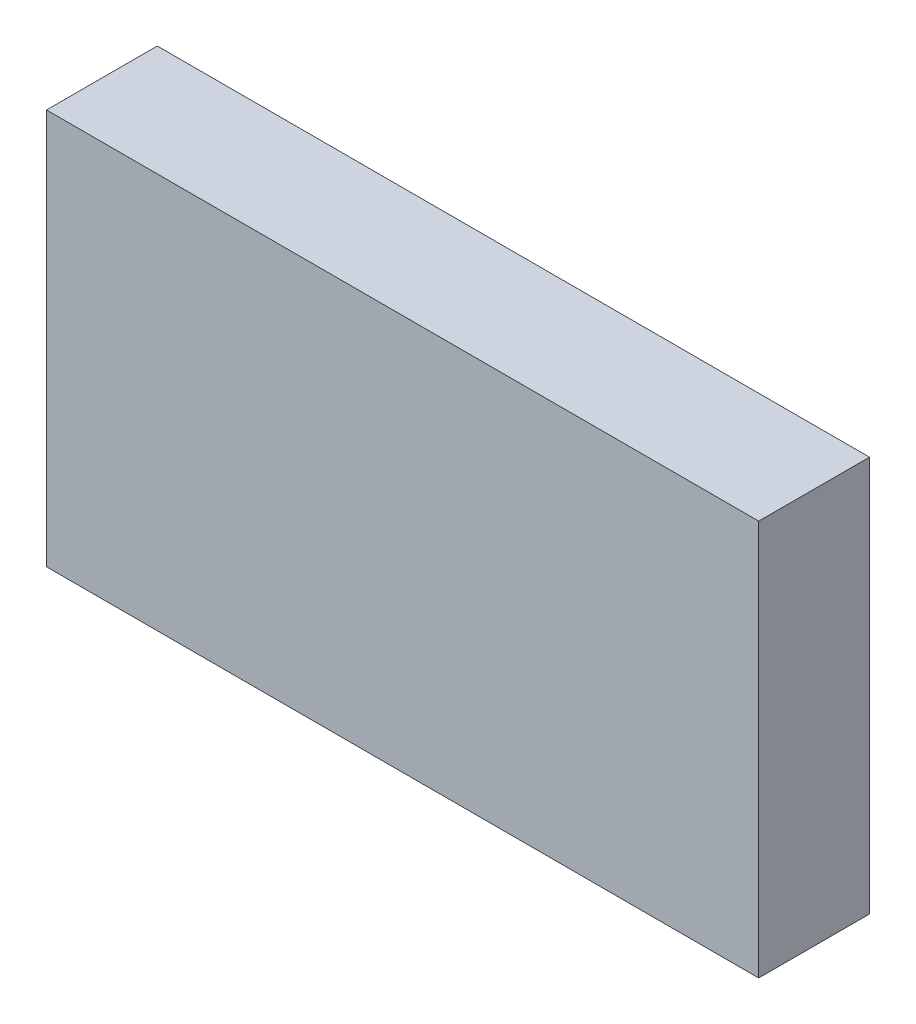
ISO-10303-21;
HEADER;
FILE_DESCRIPTION(('STEP AP214'),'2;1');
FILE_NAME('part.step','',(''),(''),'','','');
FILE_SCHEMA(('AUTOMOTIVE_DESIGN { 1 0 10303 214 1 1 1 1 }'));
ENDSEC;
DATA;
#1=APPLICATION_CONTEXT('core data for automotive mechanical design processes');
#2=APPLICATION_PROTOCOL_DEFINITION('international standard','automotive_design',2000,#1);
#3=PRODUCT_CONTEXT('',#1,'mechanical');
#4=PRODUCT('Part','Part','',(#3));
#5=PRODUCT_RELATED_PRODUCT_CATEGORY('part','',(#4));
#6=PRODUCT_DEFINITION_FORMATION('','',#4);
#7=PRODUCT_DEFINITION_CONTEXT('part definition',#1,'design');
#8=PRODUCT_DEFINITION('design','',#6,#7);
#9=PRODUCT_DEFINITION_SHAPE('','',#8);
#10=(LENGTH_UNIT() NAMED_UNIT(*) SI_UNIT(.MILLI.,.METRE.));
#11=(NAMED_UNIT(*) PLANE_ANGLE_UNIT() SI_UNIT($,.RADIAN.));
#12=(NAMED_UNIT(*) SI_UNIT($,.STERADIAN.) SOLID_ANGLE_UNIT());
#13=UNCERTAINTY_MEASURE_WITH_UNIT(LENGTH_MEASURE(1.E-05),#10,'distance_accuracy_value','');
#14=(GEOMETRIC_REPRESENTATION_CONTEXT(3) GLOBAL_UNCERTAINTY_ASSIGNED_CONTEXT((#13)) GLOBAL_UNIT_ASSIGNED_CONTEXT((#10,
#11,#12)) REPRESENTATION_CONTEXT('',''));
#15=CARTESIAN_POINT('',(0.,0.,0.));
#16=DIRECTION('',(0.,0.,1.));
#17=DIRECTION('',(1.,0.,0.));
#18=AXIS2_PLACEMENT_3D('',#15,#16,#17);
#19=CARTESIAN_POINT('',(11632.1416666658,-5656.2625,-17.78));
#20=DIRECTION('',(0.,1.,0.));
#21=DIRECTION('',(0.,0.,1.));
#22=AXIS2_PLACEMENT_3D('',#19,#20,#21);
#23=PLANE('',#22);
#24=DIRECTION('',(-1.,0.,0.));
#25=VECTOR('',#24,1.);
#26=CARTESIAN_POINT('',(11632.1416666658,-5656.2625,0.));
#27=LINE('',#26,#25);
#28=CARTESIAN_POINT('',(11632.1416666658,-5656.2625,0.));
#29=VERTEX_POINT('',#28);
#30=CARTESIAN_POINT('',(11517.8416666658,-5656.2625,0.));
#31=VERTEX_POINT('',#30);
#32=EDGE_CURVE('E95',#29,#31,#27,.T.);
#33=ORIENTED_EDGE('',*,*,#32,.F.);
#34=DIRECTION('',(0.,0.,1.));
#35=VECTOR('',#34,1.);
#36=CARTESIAN_POINT('',(11632.1416666658,-5656.2625,-17.78));
#37=LINE('',#36,#35);
#38=CARTESIAN_POINT('',(11632.1416666658,-5656.2625,-17.78));
#39=VERTEX_POINT('',#38);
#40=EDGE_CURVE('E11',#39,#29,#37,.T.);
#41=ORIENTED_EDGE('',*,*,#40,.F.);
#42=DIRECTION('',(-1.,0.,0.));
#43=VECTOR('',#42,1.);
#44=CARTESIAN_POINT('',(11632.1416666658,-5656.2625,-17.78));
#45=LINE('',#44,#43);
#46=CARTESIAN_POINT('',(11517.8416666658,-5656.2625,-17.78));
#47=VERTEX_POINT('',#46);
#48=EDGE_CURVE('E89',#39,#47,#45,.T.);
#49=ORIENTED_EDGE('',*,*,#48,.T.);
#50=DIRECTION('',(0.,0.,1.));
#51=VECTOR('',#50,1.);
#52=CARTESIAN_POINT('',(11517.8416666658,-5656.2625,-17.78));
#53=LINE('',#52,#51);
#54=EDGE_CURVE('E34',#47,#31,#53,.T.);
#55=ORIENTED_EDGE('',*,*,#54,.T.);
#56=EDGE_LOOP('',(#33,#41,#49,#55));
#57=FACE_BOUND('',#56,.T.);
#58=ADVANCED_FACE('F31',(#57),#23,.T.);
#59=CARTESIAN_POINT('',(11632.1416666658,-5719.7625,-17.78));
#60=DIRECTION('',(1.,0.,0.));
#61=DIRECTION('',(0.,0.,-1.));
#62=AXIS2_PLACEMENT_3D('',#59,#60,#61);
#63=PLANE('',#62);
#64=DIRECTION('',(0.,1.,0.));
#65=VECTOR('',#64,1.);
#66=CARTESIAN_POINT('',(11632.1416666658,-5719.7625,0.));
#67=LINE('',#66,#65);
#68=CARTESIAN_POINT('',(11632.1416666658,-5719.7625,0.));
#69=VERTEX_POINT('',#68);
#70=EDGE_CURVE('E91',#69,#29,#67,.T.);
#71=ORIENTED_EDGE('',*,*,#70,.F.);
#72=DIRECTION('',(0.,0.,1.));
#73=VECTOR('',#72,1.);
#74=CARTESIAN_POINT('',(11632.1416666658,-5719.7625,-17.78));
#75=LINE('',#74,#73);
#76=CARTESIAN_POINT('',(11632.1416666658,-5719.7625,-17.78));
#77=VERTEX_POINT('',#76);
#78=EDGE_CURVE('E40',#77,#69,#75,.T.);
#79=ORIENTED_EDGE('',*,*,#78,.F.);
#80=DIRECTION('',(0.,1.,0.));
#81=VECTOR('',#80,1.);
#82=CARTESIAN_POINT('',(11632.1416666658,-5719.7625,-17.78));
#83=LINE('',#82,#81);
#84=EDGE_CURVE('E86',#77,#39,#83,.T.);
#85=ORIENTED_EDGE('',*,*,#84,.T.);
#86=ORIENTED_EDGE('',*,*,#40,.T.);
#87=EDGE_LOOP('',(#71,#79,#85,#86));
#88=FACE_BOUND('',#87,.T.);
#89=ADVANCED_FACE('F105',(#88),#63,.T.);
#90=CARTESIAN_POINT('',(11517.8416666658,-5719.7625,-17.78));
#91=DIRECTION('',(0.,-1.,0.));
#92=DIRECTION('',(0.,0.,-1.));
#93=AXIS2_PLACEMENT_3D('',#90,#91,#92);
#94=PLANE('',#93);
#95=DIRECTION('',(1.,0.,0.));
#96=VECTOR('',#95,1.);
#97=CARTESIAN_POINT('',(11517.8416666658,-5719.7625,0.));
#98=LINE('',#97,#96);
#99=CARTESIAN_POINT('',(11517.8416666658,-5719.7625,0.));
#100=VERTEX_POINT('',#99);
#101=EDGE_CURVE('E81',#100,#69,#98,.T.);
#102=ORIENTED_EDGE('',*,*,#101,.F.);
#103=DIRECTION('',(0.,0.,1.));
#104=VECTOR('',#103,1.);
#105=CARTESIAN_POINT('',(11517.8416666658,-5719.7625,-17.78));
#106=LINE('',#105,#104);
#107=CARTESIAN_POINT('',(11517.8416666658,-5719.7625,-17.78));
#108=VERTEX_POINT('',#107);
#109=EDGE_CURVE('E76',#108,#100,#106,.T.);
#110=ORIENTED_EDGE('',*,*,#109,.F.);
#111=DIRECTION('',(1.,0.,0.));
#112=VECTOR('',#111,1.);
#113=CARTESIAN_POINT('',(11517.8416666658,-5719.7625,-17.78));
#114=LINE('',#113,#112);
#115=EDGE_CURVE('E79',#108,#77,#114,.T.);
#116=ORIENTED_EDGE('',*,*,#115,.T.);
#117=ORIENTED_EDGE('',*,*,#78,.T.);
#118=EDGE_LOOP('',(#102,#110,#116,#117));
#119=FACE_BOUND('',#118,.T.);
#120=ADVANCED_FACE('F78',(#119),#94,.T.);
#121=CARTESIAN_POINT('',(11517.8416666658,-5656.2625,-17.78));
#122=DIRECTION('',(-1.,0.,0.));
#123=DIRECTION('',(0.,0.,1.));
#124=AXIS2_PLACEMENT_3D('',#121,#122,#123);
#125=PLANE('',#124);
#126=DIRECTION('',(0.,-1.,0.));
#127=VECTOR('',#126,1.);
#128=CARTESIAN_POINT('',(11517.8416666658,-5656.2625,0.));
#129=LINE('',#128,#127);
#130=EDGE_CURVE('E98',#31,#100,#129,.T.);
#131=ORIENTED_EDGE('',*,*,#130,.F.);
#132=ORIENTED_EDGE('',*,*,#54,.F.);
#133=DIRECTION('',(0.,-1.,0.));
#134=VECTOR('',#133,1.);
#135=CARTESIAN_POINT('',(11517.8416666658,-5656.2625,-17.78));
#136=LINE('',#135,#134);
#137=EDGE_CURVE('E85',#47,#108,#136,.T.);
#138=ORIENTED_EDGE('',*,*,#137,.T.);
#139=ORIENTED_EDGE('',*,*,#109,.T.);
#140=EDGE_LOOP('',(#131,#132,#138,#139));
#141=FACE_BOUND('',#140,.T.);
#142=ADVANCED_FACE('F88',(#141),#125,.T.);
#143=CARTESIAN_POINT('',(11517.8416666658,-5656.2625,-17.78));
#144=DIRECTION('',(0.,0.,1.));
#145=DIRECTION('',(1.,0.,0.));
#146=AXIS2_PLACEMENT_3D('',#143,#144,#145);
#147=PLANE('',#146);
#148=ORIENTED_EDGE('',*,*,#48,.F.);
#149=ORIENTED_EDGE('',*,*,#84,.F.);
#150=ORIENTED_EDGE('',*,*,#115,.F.);
#151=ORIENTED_EDGE('',*,*,#137,.F.);
#152=EDGE_LOOP('',(#148,#149,#150,#151));
#153=FACE_BOUND('',#152,.T.);
#154=ADVANCED_FACE('F84',(#153),#147,.F.);
#155=CARTESIAN_POINT('',(11517.8416666658,-5656.2625,0.));
#156=DIRECTION('',(0.,0.,1.));
#157=DIRECTION('',(1.,0.,0.));
#158=AXIS2_PLACEMENT_3D('',#155,#156,#157);
#159=PLANE('',#158);
#160=ORIENTED_EDGE('',*,*,#32,.T.);
#161=ORIENTED_EDGE('',*,*,#130,.T.);
#162=ORIENTED_EDGE('',*,*,#101,.T.);
#163=ORIENTED_EDGE('',*,*,#70,.T.);
#164=EDGE_LOOP('',(#160,#161,#162,#163));
#165=FACE_BOUND('',#164,.T.);
#166=ADVANCED_FACE('F104',(#165),#159,.T.);
#167=CLOSED_SHELL('',(#58,#89,#120,#142,#154,#166));
#168=MANIFOLD_SOLID_BREP('B2',#167);
#169=ADVANCED_BREP_SHAPE_REPRESENTATION('',(#18,#168),#14);
#170=SHAPE_DEFINITION_REPRESENTATION(#9,#169);
ENDSEC;
END-ISO-10303-21;
